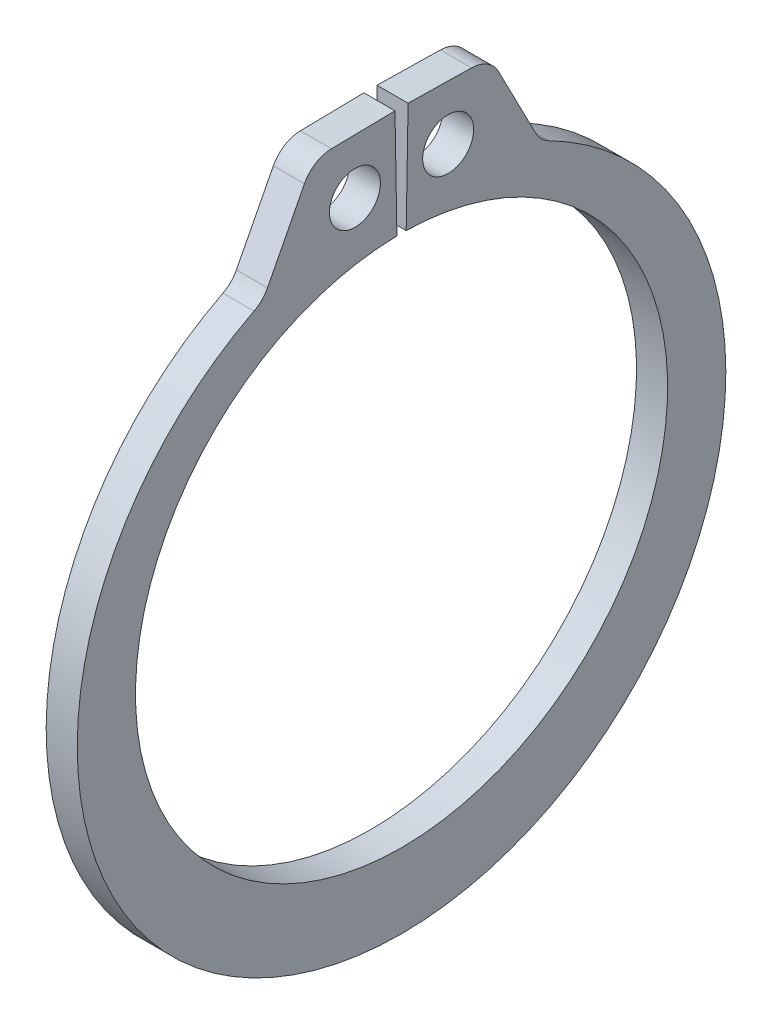
ISO-10303-21;
HEADER;
FILE_DESCRIPTION(('STEP AP214'),'2;1');
FILE_NAME('part.step','',(''),(''),'','','');
FILE_SCHEMA(('AUTOMOTIVE_DESIGN { 1 0 10303 214 1 1 1 1 }'));
ENDSEC;
DATA;
#1=APPLICATION_CONTEXT('core data for automotive mechanical design processes');
#2=APPLICATION_PROTOCOL_DEFINITION('international standard','automotive_design',2000,#1);
#3=PRODUCT_CONTEXT('',#1,'mechanical');
#4=PRODUCT('Part','Part','',(#3));
#5=PRODUCT_RELATED_PRODUCT_CATEGORY('part','',(#4));
#6=PRODUCT_DEFINITION_FORMATION('','',#4);
#7=PRODUCT_DEFINITION_CONTEXT('part definition',#1,'design');
#8=PRODUCT_DEFINITION('design','',#6,#7);
#9=PRODUCT_DEFINITION_SHAPE('','',#8);
#10=(LENGTH_UNIT() NAMED_UNIT(*) SI_UNIT(.MILLI.,.METRE.));
#11=(NAMED_UNIT(*) PLANE_ANGLE_UNIT() SI_UNIT($,.RADIAN.));
#12=(NAMED_UNIT(*) SI_UNIT($,.STERADIAN.) SOLID_ANGLE_UNIT());
#13=UNCERTAINTY_MEASURE_WITH_UNIT(LENGTH_MEASURE(1.E-05),#10,'distance_accuracy_value','');
#14=(GEOMETRIC_REPRESENTATION_CONTEXT(3) GLOBAL_UNCERTAINTY_ASSIGNED_CONTEXT((#13)) GLOBAL_UNIT_ASSIGNED_CONTEXT((#10,
#11,#12)) REPRESENTATION_CONTEXT('',''));
#15=CARTESIAN_POINT('',(0.,0.,0.));
#16=DIRECTION('',(0.,0.,1.));
#17=DIRECTION('',(1.,0.,0.));
#18=AXIS2_PLACEMENT_3D('',#15,#16,#17);
#19=CARTESIAN_POINT('',(0.3175,0.,0.));
#20=DIRECTION('',(1.,0.,0.));
#21=DIRECTION('',(0.,0.,-1.));
#22=AXIS2_PLACEMENT_3D('',#19,#20,#21);
#23=PLANE('',#22);
#24=CARTESIAN_POINT('',(0.3175,6.53757330882313,0.952441447944893));
#25=DIRECTION('',(1.,0.,0.));
#26=DIRECTION('',(0.,0.,-1.));
#27=AXIS2_PLACEMENT_3D('',#24,#25,#26);
#28=CIRCLE('',#27,0.5207);
#29=CARTESIAN_POINT('',(0.3175,6.53757330882313,0.431741447944893));
#30=VERTEX_POINT('',#29);
#31=EDGE_CURVE('E225',#30,#30,#28,.T.);
#32=ORIENTED_EDGE('',*,*,#31,.F.);
#33=EDGE_LOOP('',(#32));
#34=FACE_BOUND('',#33,.T.);
#35=DIRECTION('',(0.,-0.0174524064372838,0.999847695156391));
#36=VECTOR('',#35,1.);
#37=CARTESIAN_POINT('',(0.3175,7.66963170000565,0.133873919299114));
#38=LINE('',#37,#36);
#39=CARTESIAN_POINT('',(0.3175,7.66963170000565,0.133873919299114));
#40=VERTEX_POINT('',#39);
#41=CARTESIAN_POINT('',(0.3175,7.64699627289703,1.43065666984738));
#42=VERTEX_POINT('',#41);
#43=EDGE_CURVE('E137',#40,#42,#38,.T.);
#44=ORIENTED_EDGE('',*,*,#43,.T.);
#45=CARTESIAN_POINT('',(0.3175,7.01209298647272,1.41957439175971));
#46=DIRECTION('',(1.,0.,0.));
#47=DIRECTION('',(0.,0.,-1.));
#48=AXIS2_PLACEMENT_3D('',#45,#46,#47);
#49=CIRCLE('',#48,0.635);
#50=CARTESIAN_POINT('',(0.3175,7.30316217018413,1.98393573903074));
#51=VERTEX_POINT('',#50);
#52=EDGE_CURVE('E178',#42,#51,#49,.T.);
#53=ORIENTED_EDGE('',*,*,#52,.T.);
#54=DIRECTION('',(0.,-0.888758027198477,0.458376667262058));
#55=VECTOR('',#54,1.);
#56=CARTESIAN_POINT('',(0.3175,7.64037448585418,1.81001859545929));
#57=LINE('',#56,#55);
#58=CARTESIAN_POINT('',(0.3175,5.83993065636029,2.7385969226305));
#59=VERTEX_POINT('',#58);
#60=EDGE_CURVE('E217',#51,#59,#57,.T.);
#61=ORIENTED_EDGE('',*,*,#60,.T.);
#62=CARTESIAN_POINT('',(0.3175,6.13099984007169,3.30295826990154));
#63=DIRECTION('',(1.,0.,0.));
#64=DIRECTION('',(0.,0.,-1.));
#65=AXIS2_PLACEMENT_3D('',#62,#63,#64);
#66=CIRCLE('',#65,0.635);
#67=CARTESIAN_POINT('',(0.3175,5.56551812614203,3.0140717329858));
#68=VERTEX_POINT('',#67);
#69=EDGE_CURVE('E185',#59,#68,#66,.F.);
#70=ORIENTED_EDGE('',*,*,#69,.T.);
#71=CARTESIAN_POINT('',(0.3175,-0.334384540394774,0.));
#72=DIRECTION('',(1.,0.,0.));
#73=DIRECTION('',(0.,0.,-1.));
#74=AXIS2_PLACEMENT_3D('',#71,#72,#73);
#75=CIRCLE('',#74,6.62521545960523);
#76=CARTESIAN_POINT('',(0.3175,5.56551812614203,-3.0140717329858));
#77=VERTEX_POINT('',#76);
#78=EDGE_CURVE('E210',#68,#77,#75,.T.);
#79=ORIENTED_EDGE('',*,*,#78,.T.);
#80=CARTESIAN_POINT('',(0.3175,6.13099984007169,-3.30295826990154));
#81=DIRECTION('',(1.,0.,0.));
#82=DIRECTION('',(0.,0.,-1.));
#83=AXIS2_PLACEMENT_3D('',#80,#81,#82);
#84=CIRCLE('',#83,0.635);
#85=CARTESIAN_POINT('',(0.3175,5.83993065636029,-2.7385969226305));
#86=VERTEX_POINT('',#85);
#87=EDGE_CURVE('E11',#77,#86,#84,.F.);
#88=ORIENTED_EDGE('',*,*,#87,.T.);
#89=DIRECTION('',(0.,0.888758027198477,0.458376667262058));
#90=VECTOR('',#89,1.);
#91=CARTESIAN_POINT('',(0.3175,7.64037448585418,-1.81001859545929));
#92=LINE('',#91,#90);
#93=CARTESIAN_POINT('',(0.3175,7.30316217018413,-1.98393573903074));
#94=VERTEX_POINT('',#93);
#95=EDGE_CURVE('E209',#86,#94,#92,.T.);
#96=ORIENTED_EDGE('',*,*,#95,.T.);
#97=CARTESIAN_POINT('',(0.3175,7.01209298647272,-1.41957439175971));
#98=DIRECTION('',(1.,0.,0.));
#99=DIRECTION('',(0.,0.,-1.));
#100=AXIS2_PLACEMENT_3D('',#97,#98,#99);
#101=CIRCLE('',#100,0.635);
#102=CARTESIAN_POINT('',(0.3175,7.64699627289703,-1.43065666984738));
#103=VERTEX_POINT('',#102);
#104=EDGE_CURVE('E53',#94,#103,#101,.T.);
#105=ORIENTED_EDGE('',*,*,#104,.T.);
#106=DIRECTION('',(0.,0.0174524064372838,0.999847695156391));
#107=VECTOR('',#106,1.);
#108=CARTESIAN_POINT('',(0.3175,7.66963170000565,-0.133873919299114));
#109=LINE('',#108,#107);
#110=CARTESIAN_POINT('',(0.3175,7.66963170000565,-0.133873919299114));
#111=VERTEX_POINT('',#110);
#112=EDGE_CURVE('E214',#103,#111,#109,.T.);
#113=ORIENTED_EDGE('',*,*,#112,.T.);
#114=DIRECTION('',(0.,-0.999847695156391,0.0174524064372835));
#115=VECTOR('',#114,1.);
#116=CARTESIAN_POINT('',(0.3175,5.43477213179208,-0.0948643004304983));
#117=LINE('',#116,#115);
#118=CARTESIAN_POINT('',(0.3175,5.43477213179208,-0.0948643004304983));
#119=VERTEX_POINT('',#118);
#120=EDGE_CURVE('E143',#111,#119,#117,.T.);
#121=ORIENTED_EDGE('',*,*,#120,.T.);
#122=CARTESIAN_POINT('',(0.3175,0.,0.));
#123=DIRECTION('',(-1.,0.,0.));
#124=DIRECTION('',(0.,0.,-1.));
#125=AXIS2_PLACEMENT_3D('',#122,#123,#124);
#126=CIRCLE('',#125,5.4356);
#127=CARTESIAN_POINT('',(0.3175,5.43477213179208,0.0948643004304983));
#128=VERTEX_POINT('',#127);
#129=EDGE_CURVE('E138',#119,#128,#126,.T.);
#130=ORIENTED_EDGE('',*,*,#129,.T.);
#131=DIRECTION('',(0.,0.999847695156391,0.0174524064372835));
#132=VECTOR('',#131,1.);
#133=CARTESIAN_POINT('',(0.3175,5.43477213179208,0.0948643004304983));
#134=LINE('',#133,#132);
#135=EDGE_CURVE('E129',#128,#40,#134,.T.);
#136=ORIENTED_EDGE('',*,*,#135,.T.);
#137=EDGE_LOOP('',(#44,#53,#61,#70,#79,#88,#96,#105,#113,#121,#130,#136));
#138=FACE_BOUND('',#137,.T.);
#139=CARTESIAN_POINT('',(0.3175,6.53757330882313,-0.952441447944893));
#140=DIRECTION('',(1.,0.,0.));
#141=DIRECTION('',(0.,0.,-1.));
#142=AXIS2_PLACEMENT_3D('',#139,#140,#141);
#143=CIRCLE('',#142,0.5207);
#144=CARTESIAN_POINT('',(0.3175,6.53757330882313,-1.47314144794489));
#145=VERTEX_POINT('',#144);
#146=EDGE_CURVE('E251',#145,#145,#143,.T.);
#147=ORIENTED_EDGE('',*,*,#146,.F.);
#148=EDGE_LOOP('',(#147));
#149=FACE_BOUND('',#148,.T.);
#150=ADVANCED_FACE('F38',(#34,#138,#149),#23,.T.);
#151=CARTESIAN_POINT('',(-0.3175,0.,0.));
#152=DIRECTION('',(1.,0.,0.));
#153=DIRECTION('',(0.,0.,-1.));
#154=AXIS2_PLACEMENT_3D('',#151,#152,#153);
#155=PLANE('',#154);
#156=CARTESIAN_POINT('',(-0.3175,6.53757330882313,0.952441447944893));
#157=DIRECTION('',(1.,0.,0.));
#158=DIRECTION('',(0.,0.,-1.));
#159=AXIS2_PLACEMENT_3D('',#156,#157,#158);
#160=CIRCLE('',#159,0.5207);
#161=CARTESIAN_POINT('',(-0.3175,6.53757330882313,0.431741447944893));
#162=VERTEX_POINT('',#161);
#163=EDGE_CURVE('E248',#162,#162,#160,.T.);
#164=ORIENTED_EDGE('',*,*,#163,.T.);
#165=EDGE_LOOP('',(#164));
#166=FACE_BOUND('',#165,.T.);
#167=DIRECTION('',(0.,-0.888758027198477,0.458376667262058));
#168=VECTOR('',#167,1.);
#169=CARTESIAN_POINT('',(-0.3175,7.64037448585418,1.81001859545929));
#170=LINE('',#169,#168);
#171=CARTESIAN_POINT('',(-0.3175,7.30316217018413,1.98393573903074));
#172=VERTEX_POINT('',#171);
#173=CARTESIAN_POINT('',(-0.3175,5.83993065636029,2.7385969226305));
#174=VERTEX_POINT('',#173);
#175=EDGE_CURVE('E204',#172,#174,#170,.T.);
#176=ORIENTED_EDGE('',*,*,#175,.F.);
#177=CARTESIAN_POINT('',(-0.3175,7.01209298647272,1.41957439175971));
#178=DIRECTION('',(1.,0.,0.));
#179=DIRECTION('',(0.,0.,-1.));
#180=AXIS2_PLACEMENT_3D('',#177,#178,#179);
#181=CIRCLE('',#180,0.635);
#182=CARTESIAN_POINT('',(-0.3175,7.64699627289703,1.43065666984738));
#183=VERTEX_POINT('',#182);
#184=EDGE_CURVE('E174',#172,#183,#181,.F.);
#185=ORIENTED_EDGE('',*,*,#184,.T.);
#186=DIRECTION('',(0.,-0.0174524064372838,0.999847695156391));
#187=VECTOR('',#186,1.);
#188=CARTESIAN_POINT('',(-0.3175,7.66963170000565,0.133873919299114));
#189=LINE('',#188,#187);
#190=CARTESIAN_POINT('',(-0.3175,7.66963170000565,0.133873919299114));
#191=VERTEX_POINT('',#190);
#192=EDGE_CURVE('E227',#191,#183,#189,.T.);
#193=ORIENTED_EDGE('',*,*,#192,.F.);
#194=DIRECTION('',(0.,0.999847695156391,0.0174524064372835));
#195=VECTOR('',#194,1.);
#196=CARTESIAN_POINT('',(-0.3175,5.43477213179208,0.0948643004304983));
#197=LINE('',#196,#195);
#198=CARTESIAN_POINT('',(-0.3175,5.43477213179208,0.0948643004304983));
#199=VERTEX_POINT('',#198);
#200=EDGE_CURVE('E224',#199,#191,#197,.T.);
#201=ORIENTED_EDGE('',*,*,#200,.F.);
#202=CARTESIAN_POINT('',(-0.3175,0.,0.));
#203=DIRECTION('',(-1.,0.,0.));
#204=DIRECTION('',(0.,0.,-1.));
#205=AXIS2_PLACEMENT_3D('',#202,#203,#204);
#206=CIRCLE('',#205,5.4356);
#207=CARTESIAN_POINT('',(-0.3175,5.43477213179208,-0.0948643004304983));
#208=VERTEX_POINT('',#207);
#209=EDGE_CURVE('E151',#208,#199,#206,.T.);
#210=ORIENTED_EDGE('',*,*,#209,.F.);
#211=DIRECTION('',(0.,-0.999847695156391,0.0174524064372835));
#212=VECTOR('',#211,1.);
#213=CARTESIAN_POINT('',(-0.3175,5.43477213179208,-0.0948643004304983));
#214=LINE('',#213,#212);
#215=CARTESIAN_POINT('',(-0.3175,7.66963170000565,-0.133873919299114));
#216=VERTEX_POINT('',#215);
#217=EDGE_CURVE('E147',#216,#208,#214,.T.);
#218=ORIENTED_EDGE('',*,*,#217,.F.);
#219=DIRECTION('',(0.,0.0174524064372838,0.999847695156391));
#220=VECTOR('',#219,1.);
#221=CARTESIAN_POINT('',(-0.3175,7.66963170000565,-0.133873919299114));
#222=LINE('',#221,#220);
#223=CARTESIAN_POINT('',(-0.3175,7.64699627289703,-1.43065666984738));
#224=VERTEX_POINT('',#223);
#225=EDGE_CURVE('E232',#224,#216,#222,.T.);
#226=ORIENTED_EDGE('',*,*,#225,.F.);
#227=CARTESIAN_POINT('',(-0.3175,7.01209298647272,-1.41957439175971));
#228=DIRECTION('',(1.,0.,0.));
#229=DIRECTION('',(0.,0.,-1.));
#230=AXIS2_PLACEMENT_3D('',#227,#228,#229);
#231=CIRCLE('',#230,0.635);
#232=CARTESIAN_POINT('',(-0.3175,7.30316217018413,-1.98393573903074));
#233=VERTEX_POINT('',#232);
#234=EDGE_CURVE('E172',#224,#233,#231,.F.);
#235=ORIENTED_EDGE('',*,*,#234,.T.);
#236=DIRECTION('',(0.,0.888758027198477,0.458376667262058));
#237=VECTOR('',#236,1.);
#238=CARTESIAN_POINT('',(-0.3175,7.64037448585418,-1.81001859545929));
#239=LINE('',#238,#237);
#240=CARTESIAN_POINT('',(-0.3175,5.83993065636029,-2.7385969226305));
#241=VERTEX_POINT('',#240);
#242=EDGE_CURVE('E195',#241,#233,#239,.T.);
#243=ORIENTED_EDGE('',*,*,#242,.F.);
#244=CARTESIAN_POINT('',(-0.3175,6.13099984007169,-3.30295826990154));
#245=DIRECTION('',(1.,0.,0.));
#246=DIRECTION('',(0.,0.,-1.));
#247=AXIS2_PLACEMENT_3D('',#244,#245,#246);
#248=CIRCLE('',#247,0.635);
#249=CARTESIAN_POINT('',(-0.3175,5.56551812614203,-3.0140717329858));
#250=VERTEX_POINT('',#249);
#251=EDGE_CURVE('E46',#241,#250,#248,.T.);
#252=ORIENTED_EDGE('',*,*,#251,.T.);
#253=CARTESIAN_POINT('',(-0.3175,-0.334384540394774,0.));
#254=DIRECTION('',(1.,0.,0.));
#255=DIRECTION('',(0.,0.,-1.));
#256=AXIS2_PLACEMENT_3D('',#253,#254,#255);
#257=CIRCLE('',#256,6.62521545960523);
#258=CARTESIAN_POINT('',(-0.3175,5.56551812614203,3.0140717329858));
#259=VERTEX_POINT('',#258);
#260=EDGE_CURVE('E193',#259,#250,#257,.T.);
#261=ORIENTED_EDGE('',*,*,#260,.F.);
#262=CARTESIAN_POINT('',(-0.3175,6.13099984007169,3.30295826990154));
#263=DIRECTION('',(1.,0.,0.));
#264=DIRECTION('',(0.,0.,-1.));
#265=AXIS2_PLACEMENT_3D('',#262,#263,#264);
#266=CIRCLE('',#265,0.635);
#267=EDGE_CURVE('E183',#259,#174,#266,.T.);
#268=ORIENTED_EDGE('',*,*,#267,.T.);
#269=EDGE_LOOP('',(#176,#185,#193,#201,#210,#218,#226,#235,#243,#252,#261,#268));
#270=FACE_BOUND('',#269,.T.);
#271=CARTESIAN_POINT('',(-0.3175,6.53757330882313,-0.952441447944893));
#272=DIRECTION('',(1.,0.,0.));
#273=DIRECTION('',(0.,0.,-1.));
#274=AXIS2_PLACEMENT_3D('',#271,#272,#273);
#275=CIRCLE('',#274,0.5207);
#276=CARTESIAN_POINT('',(-0.3175,6.53757330882313,-1.47314144794489));
#277=VERTEX_POINT('',#276);
#278=EDGE_CURVE('E254',#277,#277,#275,.T.);
#279=ORIENTED_EDGE('',*,*,#278,.T.);
#280=EDGE_LOOP('',(#279));
#281=FACE_BOUND('',#280,.T.);
#282=ADVANCED_FACE('F191',(#166,#270,#281),#155,.F.);
#283=CARTESIAN_POINT('',(0.3175,0.,0.));
#284=DIRECTION('',(-1.,0.,0.));
#285=DIRECTION('',(0.,0.,1.));
#286=AXIS2_PLACEMENT_3D('',#283,#284,#285);
#287=CYLINDRICAL_SURFACE('',#286,5.4356);
#288=ORIENTED_EDGE('',*,*,#209,.T.);
#289=DIRECTION('',(-1.,0.,0.));
#290=VECTOR('',#289,1.);
#291=CARTESIAN_POINT('',(0.3175,5.43477213179208,0.0948643004304983));
#292=LINE('',#291,#290);
#293=EDGE_CURVE('E133',#128,#199,#292,.T.);
#294=ORIENTED_EDGE('',*,*,#293,.F.);
#295=ORIENTED_EDGE('',*,*,#129,.F.);
#296=DIRECTION('',(-1.,0.,0.));
#297=VECTOR('',#296,1.);
#298=CARTESIAN_POINT('',(0.3175,5.43477213179208,-0.0948643004304983));
#299=LINE('',#298,#297);
#300=EDGE_CURVE('E222',#119,#208,#299,.T.);
#301=ORIENTED_EDGE('',*,*,#300,.T.);
#302=EDGE_LOOP('',(#288,#294,#295,#301));
#303=FACE_BOUND('',#302,.T.);
#304=ADVANCED_FACE('F149',(#303),#287,.F.);
#305=CARTESIAN_POINT('',(0.3175,5.43477213179208,0.0948643004304983));
#306=DIRECTION('',(0.,-0.0174524064372835,0.999847695156391));
#307=DIRECTION('',(0.,-0.999847695156391,-0.0174524064372835));
#308=AXIS2_PLACEMENT_3D('',#305,#306,#307);
#309=PLANE('',#308);
#310=ORIENTED_EDGE('',*,*,#200,.T.);
#311=DIRECTION('',(-1.,0.,0.));
#312=VECTOR('',#311,1.);
#313=CARTESIAN_POINT('',(0.3175,7.66963170000565,0.133873919299114));
#314=LINE('',#313,#312);
#315=EDGE_CURVE('E136',#40,#191,#314,.T.);
#316=ORIENTED_EDGE('',*,*,#315,.F.);
#317=ORIENTED_EDGE('',*,*,#135,.F.);
#318=ORIENTED_EDGE('',*,*,#293,.T.);
#319=EDGE_LOOP('',(#310,#316,#317,#318));
#320=FACE_BOUND('',#319,.T.);
#321=ADVANCED_FACE('F131',(#320),#309,.F.);
#322=CARTESIAN_POINT('',(0.3175,7.66963170000565,0.133873919299114));
#323=DIRECTION('',(0.,-0.999847695156391,-0.0174524064372838));
#324=DIRECTION('',(0.,0.0174524064372838,-0.999847695156391));
#325=AXIS2_PLACEMENT_3D('',#322,#323,#324);
#326=PLANE('',#325);
#327=ORIENTED_EDGE('',*,*,#192,.T.);
#328=DIRECTION('',(-1.,0.,0.));
#329=VECTOR('',#328,1.);
#330=CARTESIAN_POINT('',(0.3175,7.64699627289703,1.43065666984739));
#331=LINE('',#330,#329);
#332=EDGE_CURVE('E61',#183,#42,#331,.F.);
#333=ORIENTED_EDGE('',*,*,#332,.T.);
#334=ORIENTED_EDGE('',*,*,#43,.F.);
#335=ORIENTED_EDGE('',*,*,#315,.T.);
#336=EDGE_LOOP('',(#327,#333,#334,#335));
#337=FACE_BOUND('',#336,.T.);
#338=ADVANCED_FACE('F243',(#337),#326,.F.);
#339=CARTESIAN_POINT('',(0.3175,7.64037448585418,1.81001859545929));
#340=DIRECTION('',(0.,-0.458376667262058,-0.888758027198477));
#341=DIRECTION('',(0.,0.888758027198477,-0.458376667262058));
#342=AXIS2_PLACEMENT_3D('',#339,#340,#341);
#343=PLANE('',#342);
#344=ORIENTED_EDGE('',*,*,#175,.T.);
#345=DIRECTION('',(1.,0.,0.));
#346=VECTOR('',#345,1.);
#347=CARTESIAN_POINT('',(0.3175,5.83993065636029,2.7385969226305));
#348=LINE('',#347,#346);
#349=EDGE_CURVE('E165',#174,#59,#348,.T.);
#350=ORIENTED_EDGE('',*,*,#349,.T.);
#351=ORIENTED_EDGE('',*,*,#60,.F.);
#352=DIRECTION('',(-1.,0.,0.));
#353=VECTOR('',#352,1.);
#354=CARTESIAN_POINT('',(0.3175,7.30316217018413,1.98393573903074));
#355=LINE('',#354,#353);
#356=EDGE_CURVE('E162',#51,#172,#355,.T.);
#357=ORIENTED_EDGE('',*,*,#356,.T.);
#358=EDGE_LOOP('',(#344,#350,#351,#357));
#359=FACE_BOUND('',#358,.T.);
#360=ADVANCED_FACE('F284',(#359),#343,.F.);
#361=CARTESIAN_POINT('',(0.3175,-0.334384540394774,0.));
#362=DIRECTION('',(-1.,0.,0.));
#363=DIRECTION('',(0.,0.,1.));
#364=AXIS2_PLACEMENT_3D('',#361,#362,#363);
#365=CYLINDRICAL_SURFACE('',#364,6.62521545960523);
#366=ORIENTED_EDGE('',*,*,#78,.F.);
#367=DIRECTION('',(-1.,0.,0.));
#368=VECTOR('',#367,1.);
#369=CARTESIAN_POINT('',(0.3175,5.56551812614203,3.0140717329858));
#370=LINE('',#369,#368);
#371=EDGE_CURVE('E154',#68,#259,#370,.T.);
#372=ORIENTED_EDGE('',*,*,#371,.T.);
#373=ORIENTED_EDGE('',*,*,#260,.T.);
#374=DIRECTION('',(-1.,0.,0.));
#375=VECTOR('',#374,1.);
#376=CARTESIAN_POINT('',(0.3175,5.56551812614203,-3.0140717329858));
#377=LINE('',#376,#375);
#378=EDGE_CURVE('E152',#250,#77,#377,.F.);
#379=ORIENTED_EDGE('',*,*,#378,.T.);
#380=EDGE_LOOP('',(#366,#372,#373,#379));
#381=FACE_BOUND('',#380,.T.);
#382=ADVANCED_FACE('F201',(#381),#365,.T.);
#383=CARTESIAN_POINT('',(0.3175,7.64037448585418,-1.81001859545929));
#384=DIRECTION('',(0.,-0.458376667262058,0.888758027198477));
#385=DIRECTION('',(0.,-0.888758027198477,-0.458376667262058));
#386=AXIS2_PLACEMENT_3D('',#383,#384,#385);
#387=PLANE('',#386);
#388=ORIENTED_EDGE('',*,*,#95,.F.);
#389=DIRECTION('',(1.,0.,0.));
#390=VECTOR('',#389,1.);
#391=CARTESIAN_POINT('',(-0.3175,5.83993065636029,-2.7385969226305));
#392=LINE('',#391,#390);
#393=EDGE_CURVE('E169',#86,#241,#392,.F.);
#394=ORIENTED_EDGE('',*,*,#393,.T.);
#395=ORIENTED_EDGE('',*,*,#242,.T.);
#396=DIRECTION('',(-1.,0.,0.));
#397=VECTOR('',#396,1.);
#398=CARTESIAN_POINT('',(0.3175,7.30316217018413,-1.98393573903074));
#399=LINE('',#398,#397);
#400=EDGE_CURVE('E167',#233,#94,#399,.F.);
#401=ORIENTED_EDGE('',*,*,#400,.T.);
#402=EDGE_LOOP('',(#388,#394,#395,#401));
#403=FACE_BOUND('',#402,.T.);
#404=ADVANCED_FACE('F212',(#403),#387,.F.);
#405=CARTESIAN_POINT('',(0.3175,7.66963170000565,-0.133873919299114));
#406=DIRECTION('',(0.,-0.999847695156391,0.0174524064372838));
#407=DIRECTION('',(0.,-0.0174524064372838,-0.999847695156391));
#408=AXIS2_PLACEMENT_3D('',#405,#406,#407);
#409=PLANE('',#408);
#410=ORIENTED_EDGE('',*,*,#112,.F.);
#411=DIRECTION('',(-1.,0.,0.));
#412=VECTOR('',#411,1.);
#413=CARTESIAN_POINT('',(0.3175,7.64699627289703,-1.43065666984738));
#414=LINE('',#413,#412);
#415=EDGE_CURVE('E180',#103,#224,#414,.T.);
#416=ORIENTED_EDGE('',*,*,#415,.T.);
#417=ORIENTED_EDGE('',*,*,#225,.T.);
#418=DIRECTION('',(-1.,0.,0.));
#419=VECTOR('',#418,1.);
#420=CARTESIAN_POINT('',(0.3175,7.66963170000565,-0.133873919299114));
#421=LINE('',#420,#419);
#422=EDGE_CURVE('E156',#111,#216,#421,.T.);
#423=ORIENTED_EDGE('',*,*,#422,.F.);
#424=EDGE_LOOP('',(#410,#416,#417,#423));
#425=FACE_BOUND('',#424,.T.);
#426=ADVANCED_FACE('F277',(#425),#409,.F.);
#427=CARTESIAN_POINT('',(0.3175,5.43477213179208,-0.0948643004304983));
#428=DIRECTION('',(0.,-0.0174524064372835,-0.999847695156391));
#429=DIRECTION('',(0.,0.999847695156391,-0.0174524064372835));
#430=AXIS2_PLACEMENT_3D('',#427,#428,#429);
#431=PLANE('',#430);
#432=ORIENTED_EDGE('',*,*,#217,.T.);
#433=ORIENTED_EDGE('',*,*,#300,.F.);
#434=ORIENTED_EDGE('',*,*,#120,.F.);
#435=ORIENTED_EDGE('',*,*,#422,.T.);
#436=EDGE_LOOP('',(#432,#433,#434,#435));
#437=FACE_BOUND('',#436,.T.);
#438=ADVANCED_FACE('F239',(#437),#431,.F.);
#439=CARTESIAN_POINT('',(0.3175,6.53757330882313,0.952441447944893));
#440=DIRECTION('',(-1.,0.,0.));
#441=DIRECTION('',(0.,0.,1.));
#442=AXIS2_PLACEMENT_3D('',#439,#440,#441);
#443=CYLINDRICAL_SURFACE('',#442,0.5207);
#444=ORIENTED_EDGE('',*,*,#31,.T.);
#445=EDGE_LOOP('',(#444));
#446=FACE_BOUND('',#445,.T.);
#447=ORIENTED_EDGE('',*,*,#163,.F.);
#448=EDGE_LOOP('',(#447));
#449=FACE_BOUND('',#448,.T.);
#450=ADVANCED_FACE('F272',(#446,#449),#443,.F.);
#451=CARTESIAN_POINT('',(0.3175,6.53757330882313,-0.952441447944893));
#452=DIRECTION('',(-1.,0.,0.));
#453=DIRECTION('',(0.,0.,1.));
#454=AXIS2_PLACEMENT_3D('',#451,#452,#453);
#455=CYLINDRICAL_SURFACE('',#454,0.5207);
#456=ORIENTED_EDGE('',*,*,#146,.T.);
#457=EDGE_LOOP('',(#456));
#458=FACE_BOUND('',#457,.T.);
#459=ORIENTED_EDGE('',*,*,#278,.F.);
#460=EDGE_LOOP('',(#459));
#461=FACE_BOUND('',#460,.T.);
#462=ADVANCED_FACE('F260',(#458,#461),#455,.F.);
#463=CARTESIAN_POINT('',(0.3175,6.13099984007169,3.30295826990154));
#464=DIRECTION('',(-1.,0.,0.));
#465=DIRECTION('',(0.,0.,1.));
#466=AXIS2_PLACEMENT_3D('',#463,#464,#465);
#467=CYLINDRICAL_SURFACE('',#466,0.635);
#468=ORIENTED_EDGE('',*,*,#69,.F.);
#469=ORIENTED_EDGE('',*,*,#349,.F.);
#470=ORIENTED_EDGE('',*,*,#267,.F.);
#471=ORIENTED_EDGE('',*,*,#371,.F.);
#472=EDGE_LOOP('',(#468,#469,#470,#471));
#473=FACE_BOUND('',#472,.T.);
#474=ADVANCED_FACE('F294',(#473),#467,.F.);
#475=CARTESIAN_POINT('',(0.3175,6.13099984007169,-3.30295826990154));
#476=DIRECTION('',(-1.,0.,0.));
#477=DIRECTION('',(0.,0.,1.));
#478=AXIS2_PLACEMENT_3D('',#475,#476,#477);
#479=CYLINDRICAL_SURFACE('',#478,0.635);
#480=ORIENTED_EDGE('',*,*,#87,.F.);
#481=ORIENTED_EDGE('',*,*,#378,.F.);
#482=ORIENTED_EDGE('',*,*,#251,.F.);
#483=ORIENTED_EDGE('',*,*,#393,.F.);
#484=EDGE_LOOP('',(#480,#481,#482,#483));
#485=FACE_BOUND('',#484,.T.);
#486=ADVANCED_FACE('F207',(#485),#479,.F.);
#487=CARTESIAN_POINT('',(0.3175,7.01209298647272,1.41957439175971));
#488=DIRECTION('',(-1.,0.,0.));
#489=DIRECTION('',(0.,0.,1.));
#490=AXIS2_PLACEMENT_3D('',#487,#488,#489);
#491=CYLINDRICAL_SURFACE('',#490,0.635);
#492=ORIENTED_EDGE('',*,*,#52,.F.);
#493=ORIENTED_EDGE('',*,*,#332,.F.);
#494=ORIENTED_EDGE('',*,*,#184,.F.);
#495=ORIENTED_EDGE('',*,*,#356,.F.);
#496=EDGE_LOOP('',(#492,#493,#494,#495));
#497=FACE_BOUND('',#496,.T.);
#498=ADVANCED_FACE('F299',(#497),#491,.T.);
#499=CARTESIAN_POINT('',(0.3175,7.01209298647272,-1.41957439175971));
#500=DIRECTION('',(-1.,0.,0.));
#501=DIRECTION('',(0.,0.,1.));
#502=AXIS2_PLACEMENT_3D('',#499,#500,#501);
#503=CYLINDRICAL_SURFACE('',#502,0.635);
#504=ORIENTED_EDGE('',*,*,#104,.F.);
#505=ORIENTED_EDGE('',*,*,#400,.F.);
#506=ORIENTED_EDGE('',*,*,#234,.F.);
#507=ORIENTED_EDGE('',*,*,#415,.F.);
#508=EDGE_LOOP('',(#504,#505,#506,#507));
#509=FACE_BOUND('',#508,.T.);
#510=ADVANCED_FACE('F40',(#509),#503,.T.);
#511=CLOSED_SHELL('',(#150,#282,#304,#321,#338,#360,#382,#404,#426,#438,#450,#462,#474,#486,
#498,#510));
#512=MANIFOLD_SOLID_BREP('B2',#511);
#513=ADVANCED_BREP_SHAPE_REPRESENTATION('',(#18,#512),#14);
#514=SHAPE_DEFINITION_REPRESENTATION(#9,#513);
ENDSEC;
END-ISO-10303-21;
